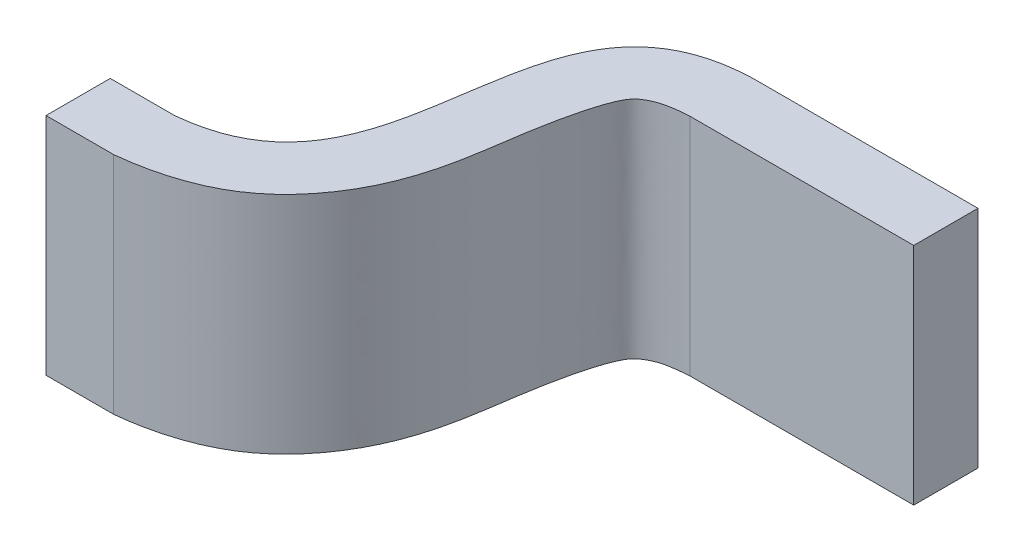
ISO-10303-21;
HEADER;
FILE_DESCRIPTION(('STEP AP214'),'2;1');
FILE_NAME('part.step','',(''),(''),'','','');
FILE_SCHEMA(('AUTOMOTIVE_DESIGN { 1 0 10303 214 1 1 1 1 }'));
ENDSEC;
DATA;
#1=APPLICATION_CONTEXT('core data for automotive mechanical design processes');
#2=APPLICATION_PROTOCOL_DEFINITION('international standard','automotive_design',2000,#1);
#3=PRODUCT_CONTEXT('',#1,'mechanical');
#4=PRODUCT('Part','Part','',(#3));
#5=PRODUCT_RELATED_PRODUCT_CATEGORY('part','',(#4));
#6=PRODUCT_DEFINITION_FORMATION('','',#4);
#7=PRODUCT_DEFINITION_CONTEXT('part definition',#1,'design');
#8=PRODUCT_DEFINITION('design','',#6,#7);
#9=PRODUCT_DEFINITION_SHAPE('','',#8);
#10=(LENGTH_UNIT() NAMED_UNIT(*) SI_UNIT(.MILLI.,.METRE.));
#11=(NAMED_UNIT(*) PLANE_ANGLE_UNIT() SI_UNIT($,.RADIAN.));
#12=(NAMED_UNIT(*) SI_UNIT($,.STERADIAN.) SOLID_ANGLE_UNIT());
#13=UNCERTAINTY_MEASURE_WITH_UNIT(LENGTH_MEASURE(1.E-05),#10,'distance_accuracy_value','');
#14=(GEOMETRIC_REPRESENTATION_CONTEXT(3) GLOBAL_UNCERTAINTY_ASSIGNED_CONTEXT((#13)) GLOBAL_UNIT_ASSIGNED_CONTEXT((#10,
#11,#12)) REPRESENTATION_CONTEXT('',''));
#15=CARTESIAN_POINT('',(0.,0.,0.));
#16=DIRECTION('',(0.,0.,1.));
#17=DIRECTION('',(1.,0.,0.));
#18=AXIS2_PLACEMENT_3D('',#15,#16,#17);
#19=CARTESIAN_POINT('',(0.381074398756027,2.52309917032561,1.20000011583518));
#20=DIRECTION('',(0.,1.,4.37113882867379E-08));
#21=DIRECTION('',(-1.,0.,0.));
#22=AXIS2_PLACEMENT_3D('',#19,#20,#21);
#23=PLANE('',#22);
#24=DIRECTION('',(1.,0.,0.));
#25=VECTOR('',#24,1.);
#26=CARTESIAN_POINT('',(8.21957818049203,2.523099214037,0.200000115835179));
#27=LINE('',#26,#25);
#28=CARTESIAN_POINT('',(8.21957818049203,2.523099214037,0.200000115835179));
#29=VERTEX_POINT('',#28);
#30=CARTESIAN_POINT('',(8.91607439875603,2.523099214037,0.200000115835179));
#31=VERTEX_POINT('',#30);
#32=EDGE_CURVE('E11',#29,#31,#27,.T.);
#33=ORIENTED_EDGE('',*,*,#32,.F.);
#34=CARTESIAN_POINT('',(8.21957818049203,2.523099214037,0.200000115835179));
#35=CARTESIAN_POINT('',(8.21401047042364,2.52309921402727,0.200222776944905));
#36=CARTESIAN_POINT('',(8.2084492375196,2.52309921401197,0.200572641902588));
#37=CARTESIAN_POINT('',(8.19734075645456,2.5230992139714,0.201500774403511));
#38=CARTESIAN_POINT('',(8.19179352491145,2.52309921394612,0.202079242715003));
#39=CARTESIAN_POINT('',(8.1806812900785,2.52309921388649,0.203443322434662));
#40=CARTESIAN_POINT('',(8.17511647873245,2.52309921385208,0.204230494227507));
#41=CARTESIAN_POINT('',(8.16402483417436,2.52309921377334,0.206032025455519));
#42=CARTESIAN_POINT('',(8.15849799412173,2.523099213729,0.207046342801843));
#43=CARTESIAN_POINT('',(8.14658674806992,2.52309921361617,0.209627439938685));
#44=CARTESIAN_POINT('',(8.14021486717337,2.52309921354485,0.211258532996008));
#45=CARTESIAN_POINT('',(8.12922884181096,2.52309921338631,0.214886282236413));
#46=CARTESIAN_POINT('',(8.12455816053052,2.52309921330695,0.21670276057125));
#47=CARTESIAN_POINT('',(8.11576316126025,2.52309921313023,0.220743140574117));
#48=CARTESIAN_POINT('',(8.11162296951039,2.52309921303433,0.222934029282874));
#49=CARTESIAN_POINT('',(8.10254423156373,2.52309921280874,0.228105288870863));
#50=CARTESIAN_POINT('',(8.09763875402522,2.52309921267634,0.231151795559119));
#51=CARTESIAN_POINT('',(8.09023645619511,2.52309921241795,0.237031494419059));
#52=CARTESIAN_POINT('',(8.08750404217203,2.52309921230647,0.239554186113198));
#53=CARTESIAN_POINT('',(8.08247327048636,2.52309921207143,0.245002831356052));
#54=CARTESIAN_POINT('',(8.08017570164472,2.52309921194784,0.247929501418367));
#55=CARTESIAN_POINT('',(8.07600750655781,2.52309921168262,0.253960636256992));
#56=CARTESIAN_POINT('',(8.07412791295759,2.52309921154149,0.257059103738853));
#57=CARTESIAN_POINT('',(8.07061884711942,2.52309921126739,0.263392983262519));
#58=CARTESIAN_POINT('',(8.06898949912773,2.52309921113442,0.266628462319743));
#59=CARTESIAN_POINT('',(8.06368568552224,2.52309921066809,0.27784996142524));
#60=CARTESIAN_POINT('',(8.06041325635019,2.52309921031974,0.286022147622744));
#61=CARTESIAN_POINT('',(8.05219767575063,2.52309920934111,0.308422259036948));
#62=CARTESIAN_POINT('',(8.04772694785476,2.52309920868692,0.322813352311754));
#63=CARTESIAN_POINT('',(8.03962993037269,2.52309920741242,0.351470017552813));
#64=CARTESIAN_POINT('',(8.03598677320328,2.52309920679168,0.365731021163682));
#65=CARTESIAN_POINT('',(8.0292057912753,2.52309920554215,0.39436223602706));
#66=CARTESIAN_POINT('',(8.026067670572,2.52309920491338,0.408732378117503));
#67=CARTESIAN_POINT('',(8.01737649852023,2.5230992030587,0.451139639563148));
#68=CARTESIAN_POINT('',(8.01233758089064,2.52309920182899,0.47928285266773));
#69=CARTESIAN_POINT('',(8.0033688768371,2.5230991993584,0.535811291131599));
#70=CARTESIAN_POINT('',(7.99944209123785,2.52309919811749,0.564196962317594));
#71=CARTESIAN_POINT('',(7.99171406777027,2.52309919586484,0.615729883457316));
#72=CARTESIAN_POINT('',(7.98801955213797,2.52309919485241,0.638892226484107));
#73=CARTESIAN_POINT('',(7.97944793328662,2.52309919283673,0.685005925928554));
#74=CARTESIAN_POINT('',(7.97457098452208,2.52309919183349,0.707957309496567));
#75=CARTESIAN_POINT('',(7.96312511462686,2.5230991898501,0.75333171452918));
#76=CARTESIAN_POINT('',(7.95656434385538,2.52309918886988,0.775756728489751));
#77=CARTESIAN_POINT('',(7.94138023978948,2.52309918694059,0.819893767638996));
#78=CARTESIAN_POINT('',(7.93275798105253,2.52309918599151,0.841606157601738));
#79=CARTESIAN_POINT('',(7.91045031887107,2.52309918386922,0.890158492103329));
#80=CARTESIAN_POINT('',(7.89602176505836,2.52309918271068,0.91666275844051));
#81=CARTESIAN_POINT('',(7.86348674764205,2.52309918049229,0.967413518681065));
#82=CARTESIAN_POINT('',(7.84537217243352,2.52309917943267,0.991654858034515));
#83=CARTESIAN_POINT('',(7.80791242379023,2.5230991775742,1.03417172187135));
#84=CARTESIAN_POINT('',(7.78898672481745,2.52309917675931,1.05281426512947));
#85=CARTESIAN_POINT('',(7.74845805610151,2.52309917527256,1.0868270722472));
#86=CARTESIAN_POINT('',(7.72686395650978,2.52309917460025,1.10220773934811));
#87=CARTESIAN_POINT('',(7.68360712676313,2.52309917348125,1.12780737627416));
#88=CARTESIAN_POINT('',(7.66215097272193,2.52309917301908,1.13838063101694));
#89=CARTESIAN_POINT('',(7.61807803282734,2.52309917220848,1.15692500960786));
#90=CARTESIAN_POINT('',(7.59545709543127,2.5230991718605,1.16488595544565));
#91=CARTESIAN_POINT('',(7.54849735175116,2.52309917125163,1.17881519350098));
#92=CARTESIAN_POINT('',(7.52412722595023,2.52309917099544,1.18467623918143));
#93=CARTESIAN_POINT('',(7.47515350623731,2.52309917058663,1.19402877138319));
#94=CARTESIAN_POINT('',(7.45055381030961,2.52309917043313,1.19754050603349));
#95=CARTESIAN_POINT('',(7.42587357560403,2.52309917032561,1.20000011583518));
#96=B_SPLINE_CURVE_WITH_KNOTS('',3,(#34,#35,#36,#37,#38,#39,#40,#41,#42,#43,#44,#45,#46,#47,#48,
#49,#50,#51,#52,#53,#54,#55,#56,#57,#58,#59,#60,#61,#62,#63,#64,#65,#66,#67,#68,#69,#70,#71,#72,
#73,#74,#75,#76,#77,#78,#79,#80,#81,#82,#83,#84,#85,#86,#87,#88,#89,#90,#91,#92,#93,#94,#95),
.UNSPECIFIED.,.F.,.F.,(4,2,2,2,2,2,2,2,2,2,2,2,2,2,2,2,2,2,2,2,2,2,2,2,2,2,2,2,2,2,4),(0.,
0.0167129049826591,0.0334405206169283,0.050296911907848,0.0671501823813316,0.0868449977925691,
0.101838970321109,0.115885127156855,0.133132127804881,0.14423621311223,0.155360252414292,
0.166215762863012,0.177076645740443,0.203446553112081,0.248618617741092,0.292765096579113,
0.336885611219413,0.422622380023038,0.508588331833534,0.57894141481707,0.649285312924717,
0.719294937731862,0.789268149044624,0.879502218060834,0.96993705004023,1.04934324822106,
1.12849225200604,1.200024637838,1.27183250557102,1.34691026454657,1.42133231106535),.UNSPECIFIED.);
#97=CARTESIAN_POINT('',(7.42587357560403,2.52309917032561,1.20000011583518));
#98=VERTEX_POINT('',#97);
#99=EDGE_CURVE('E144',#29,#98,#96,.T.);
#100=ORIENTED_EDGE('',*,*,#99,.T.);
#101=DIRECTION('',(1.,0.,0.));
#102=VECTOR('',#101,1.);
#103=CARTESIAN_POINT('',(7.21607439875603,2.52309917032561,1.20000011583518));
#104=LINE('',#103,#102);
#105=CARTESIAN_POINT('',(7.21607439875603,2.52309917032561,1.20000011583518));
#106=VERTEX_POINT('',#105);
#107=EDGE_CURVE('E153',#106,#98,#104,.T.);
#108=ORIENTED_EDGE('',*,*,#107,.F.);
#109=DIRECTION('',(0.,4.37113878426487E-08,-0.999999999999999));
#110=VECTOR('',#109,1.);
#111=CARTESIAN_POINT('',(7.21607439875603,2.52309917032561,1.20000011583518));
#112=LINE('',#111,#110);
#113=CARTESIAN_POINT('',(7.21607439875603,2.52309917906789,1.00000011583518));
#114=VERTEX_POINT('',#113);
#115=EDGE_CURVE('E176',#106,#114,#112,.T.);
#116=ORIENTED_EDGE('',*,*,#115,.T.);
#117=DIRECTION('',(-1.,0.,0.));
#118=VECTOR('',#117,1.);
#119=CARTESIAN_POINT('',(7.41607439875603,2.52309917906788,1.00000011583518));
#120=LINE('',#119,#118);
#121=CARTESIAN_POINT('',(7.41607439875603,2.52309917906789,1.00000011583518));
#122=VERTEX_POINT('',#121);
#123=EDGE_CURVE('E166',#122,#114,#120,.T.);
#124=ORIENTED_EDGE('',*,*,#123,.F.);
#125=CARTESIAN_POINT('',(8.21607439875603,2.52309922277927,1.15835178985639E-07));
#126=CARTESIAN_POINT('',(8.19359750090305,2.52309922274641,0.000752060468584343));
#127=CARTESIAN_POINT('',(8.17102033253113,2.52309922266874,0.00252901377854264));
#128=CARTESIAN_POINT('',(8.12598549255526,2.52309922238647,0.00898640023387568));
#129=CARTESIAN_POINT('',(8.10353378116303,2.52309922218014,0.0137066074111801));
#130=CARTESIAN_POINT('',(8.06516605596456,2.52309922167395,0.0252870083113101));
#131=CARTESIAN_POINT('',(8.04901169028135,2.52309922141004,0.0313245870723105));
#132=CARTESIAN_POINT('',(8.01790380459713,2.52309922077657,0.0458166204881481));
#133=CARTESIAN_POINT('',(8.00294442627384,2.52309922040757,0.0542582222089984));
#134=CARTESIAN_POINT('',(7.97582167191426,2.52309921959494,0.0728490012215342));
#135=CARTESIAN_POINT('',(7.96353091436025,2.52309921915947,0.0828115771405222));
#136=CARTESIAN_POINT('',(7.94070621502396,2.52309921820722,0.104596721389232));
#137=CARTESIAN_POINT('',(7.93017445817697,2.52309921769033,0.116421568042135));
#138=CARTESIAN_POINT('',(7.90935508116188,2.5230992165021,0.14360516530755));
#139=CARTESIAN_POINT('',(7.89940970116876,2.52309921581941,0.159223393880875));
#140=CARTESIAN_POINT('',(7.88179108799282,2.52309921439959,0.191705024628725));
#141=CARTESIAN_POINT('',(7.8741236490106,2.52309921366233,0.208571468087363));
#142=CARTESIAN_POINT('',(7.85832464058284,2.52309921190374,0.248803432527051));
#143=CARTESIAN_POINT('',(7.85090890706547,2.52309921087046,0.272442120704842));
#144=CARTESIAN_POINT('',(7.83820894045457,2.52309920878153,0.320231127397664));
#145=CARTESIAN_POINT('',(7.83292359852321,2.5230992077259,0.34438117285117));
#146=CARTESIAN_POINT('',(7.82020763349268,2.52309920485188,0.410131041851887));
#147=CARTESIAN_POINT('',(7.81392194525158,2.5230992030246,0.451934402083062));
#148=CARTESIAN_POINT('',(7.8012428083788,2.52309919936021,0.535765928705813));
#149=CARTESIAN_POINT('',(7.79484895474965,2.52309919752309,0.577794051692639));
#150=CARTESIAN_POINT('',(7.78273984807099,2.52309919483153,0.639369848598377));
#151=CARTESIAN_POINT('',(7.77842057810017,2.52309919396597,0.659171782886781));
#152=CARTESIAN_POINT('',(7.76847573352189,2.52309919224811,0.698471838212415));
#153=CARTESIAN_POINT('',(7.76284917548215,2.52309919139583,0.717969718676912));
#154=CARTESIAN_POINT('',(7.74981596903728,2.52309918972668,0.756155364665875));
#155=CARTESIAN_POINT('',(7.74242864611761,2.52309918890953,0.774849489753709));
#156=CARTESIAN_POINT('',(7.72530005700014,2.52309918732471,0.81110604819965));
#157=CARTESIAN_POINT('',(7.71556458954354,2.52309918655692,0.828671136436785));
#158=CARTESIAN_POINT('',(7.69292951988902,2.52309918507648,0.862539616126326));
#159=CARTESIAN_POINT('',(7.67993520495926,2.52309918436653,0.878781377405072));
#160=CARTESIAN_POINT('',(7.65100399267901,2.52309918307223,0.908391476138886));
#161=CARTESIAN_POINT('',(7.63506980602138,2.52309918248776,0.921762436225387));
#162=CARTESIAN_POINT('',(7.60252456066282,2.52309918151385,0.944042929275911));
#163=CARTESIAN_POINT('',(7.58611569627056,2.52309918111129,0.953252501908176));
#164=CARTESIAN_POINT('',(7.55201487673193,2.52309918042161,0.969030528465975));
#165=CARTESIAN_POINT('',(7.53431790582258,2.52309918013498,0.975587925812752));
#166=CARTESIAN_POINT('',(7.4998876879737,2.52309917968513,0.985879214749981));
#167=CARTESIAN_POINT('',(7.48321202321778,2.5230991795131,0.989814821998697));
#168=CARTESIAN_POINT('',(7.44972396115948,2.52309917924115,0.996036316685444));
#169=CARTESIAN_POINT('',(7.43291463042139,2.52309917914053,0.998338413303284));
#170=CARTESIAN_POINT('',(7.41607439875603,2.52309917906789,1.00000011583518));
#171=B_SPLINE_CURVE_WITH_KNOTS('',3,(#125,#126,#127,#128,#129,#130,#131,#132,#133,#134,#135,
#136,#137,#138,#139,#140,#141,#142,#143,#144,#145,#146,#147,#148,#149,#150,#151,#152,#153,#154,
#155,#156,#157,#158,#159,#160,#161,#162,#163,#164,#165,#166,#167,#168,#169,#170),.UNSPECIFIED.,
.F.,.F.,(4,2,2,2,2,2,2,2,2,2,2,2,2,2,2,2,2,2,2,2,2,2,4),(0.,0.0676605368254357,
0.136255841823746,0.187815232472052,0.239103979458826,0.286357475935168,0.333669238509407,
0.388978971846573,0.444428210357162,0.518581097757565,0.592695339665637,0.719482422739696,
0.846974988060583,0.907746805484861,0.96856448853661,1.02874313069962,1.08877465652057,
1.15080863583324,1.21278570033355,1.26897458836371,1.32539536427915,1.3767136749948,
1.42751535438906),.UNSPECIFIED.);
#172=CARTESIAN_POINT('',(8.21607439875603,2.52309922277927,1.15835178959856E-07));
#173=VERTEX_POINT('',#172);
#174=EDGE_CURVE('E99',#173,#122,#171,.T.);
#175=ORIENTED_EDGE('',*,*,#174,.F.);
#176=DIRECTION('',(1.,0.,0.));
#177=VECTOR('',#176,1.);
#178=CARTESIAN_POINT('',(8.21607439875603,2.52309922277928,1.15835178959856E-07));
#179=LINE('',#178,#177);
#180=CARTESIAN_POINT('',(8.91607439875603,2.52309922277927,1.15835178959856E-07));
#181=VERTEX_POINT('',#180);
#182=EDGE_CURVE('E93',#173,#181,#179,.T.);
#183=ORIENTED_EDGE('',*,*,#182,.T.);
#184=DIRECTION('',(0.,4.37113878426487E-08,-0.999999999999999));
#185=VECTOR('',#184,1.);
#186=CARTESIAN_POINT('',(8.91607439875603,2.523099214037,0.200000115835179));
#187=LINE('',#186,#185);
#188=EDGE_CURVE('E145',#31,#181,#187,.T.);
#189=ORIENTED_EDGE('',*,*,#188,.F.);
#190=EDGE_LOOP('',(#33,#100,#108,#116,#124,#175,#183,#189));
#191=FACE_BOUND('',#190,.T.);
#192=ADVANCED_FACE('F17',(#191),#23,.F.);
#193=CARTESIAN_POINT('',(8.91607439875603,-0.126900829674392,1.2));
#194=DIRECTION('',(-1.,0.,0.));
#195=DIRECTION('',(0.,-1.,-4.37113882867379E-08));
#196=AXIS2_PLACEMENT_3D('',#193,#194,#195);
#197=PLANE('',#196);
#198=DIRECTION('',(0.,-0.999999999999999,-4.37113883184585E-08));
#199=VECTOR('',#198,1.);
#200=CARTESIAN_POINT('',(8.91607439875603,3.223099214037,0.200000146433151));
#201=LINE('',#200,#199);
#202=CARTESIAN_POINT('',(8.91607439875603,3.223099214037,0.200000146433151));
#203=VERTEX_POINT('',#202);
#204=EDGE_CURVE('E25',#203,#31,#201,.T.);
#205=ORIENTED_EDGE('',*,*,#204,.T.);
#206=ORIENTED_EDGE('',*,*,#188,.T.);
#207=DIRECTION('',(0.,0.999999999999999,4.37113882867379E-08));
#208=VECTOR('',#207,1.);
#209=CARTESIAN_POINT('',(8.91607439875603,2.52309922277927,1.15835178959856E-07));
#210=LINE('',#209,#208);
#211=CARTESIAN_POINT('',(8.91607439875603,3.22309922277927,1.46433150760572E-07));
#212=VERTEX_POINT('',#211);
#213=EDGE_CURVE('E178',#181,#212,#210,.T.);
#214=ORIENTED_EDGE('',*,*,#213,.T.);
#215=DIRECTION('',(0.,4.37113856222026E-08,-0.999999999999999));
#216=VECTOR('',#215,1.);
#217=CARTESIAN_POINT('',(8.91607439875603,3.223099214037,0.200000146433151));
#218=LINE('',#217,#216);
#219=EDGE_CURVE('E168',#203,#212,#218,.T.);
#220=ORIENTED_EDGE('',*,*,#219,.F.);
#221=EDGE_LOOP('',(#205,#206,#214,#220));
#222=FACE_BOUND('',#221,.T.);
#223=ADVANCED_FACE('F129',(#222),#197,.F.);
#224=CARTESIAN_POINT('',(0.381074398756027,3.22309917032561,1.20000014643315));
#225=DIRECTION('',(0.,1.,4.37113882867379E-08));
#226=DIRECTION('',(-1.,0.,0.));
#227=AXIS2_PLACEMENT_3D('',#224,#225,#226);
#228=PLANE('',#227);
#229=CARTESIAN_POINT('',(7.42587357560403,3.22309917032561,1.20000014643315));
#230=CARTESIAN_POINT('',(7.44450696231857,3.22309917040612,1.19815829311156));
#231=CARTESIAN_POINT('',(7.46308378697548,3.22309917051351,1.1957015166836));
#232=CARTESIAN_POINT('',(7.50006101029373,3.22309917078471,1.18949711709641));
#233=CARTESIAN_POINT('',(7.51846094169025,3.22309917094865,1.18574671960165));
#234=CARTESIAN_POINT('',(7.55510393371644,3.22309917133702,1.1768617432686));
#235=CARTESIAN_POINT('',(7.57334409155655,3.22309917156199,1.17171500907457));
#236=CARTESIAN_POINT('',(7.60932052096594,3.22309917207712,1.15993021636413));
#237=CARTESIAN_POINT('',(7.62705717651152,3.22309917236723,1.15329333065392));
#238=CARTESIAN_POINT('',(7.66764342416262,3.22309917313077,1.13582561747603));
#239=CARTESIAN_POINT('',(7.69022170006956,3.22309917363307,1.12433441236624));
#240=CARTESIAN_POINT('',(7.73311709417893,3.2230991747892,1.09788519223996));
#241=CARTESIAN_POINT('',(7.75344430120095,3.22309917544231,1.08294365553174));
#242=CARTESIAN_POINT('',(7.79010917597914,3.2230991768155,1.05152865848007));
#243=CARTESIAN_POINT('',(7.80663564372869,3.22309917752611,1.03527196246281));
#244=CARTESIAN_POINT('',(7.83757005773216,3.22309917903329,1.00079164379412));
#245=CARTESIAN_POINT('',(7.85197241919277,3.22309917983008,0.982563046992551));
#246=CARTESIAN_POINT('',(7.8802341685402,3.22309918158959,0.942310265469554));
#247=CARTESIAN_POINT('',(7.89381844801596,3.22309918256072,0.920093478990381));
#248=CARTESIAN_POINT('',(7.91820429984428,3.22309918456551,0.874229263846631));
#249=CARTESIAN_POINT('',(7.92900959422008,3.22309918559908,0.850583801679557));
#250=CARTESIAN_POINT('',(7.94871551674147,3.22309918779927,0.800249273213149));
#251=CARTESIAN_POINT('',(7.95738403816721,3.22309918896982,0.773470381934673));
#252=CARTESIAN_POINT('',(7.97210425943558,3.22309919134218,0.719197126059223));
#253=CARTESIAN_POINT('',(7.97815277621527,3.22309919254403,0.691701933955639));
#254=CARTESIAN_POINT('',(7.98659346655188,3.22309919451031,0.646718729204653));
#255=CARTESIAN_POINT('',(7.98950808079972,3.22309919527076,0.629321589990211));
#256=CARTESIAN_POINT('',(7.99495752836008,3.22309919679438,0.594465181726221));
#257=CARTESIAN_POINT('',(7.99749227542006,3.22309919755755,0.577005899485014));
#258=CARTESIAN_POINT('',(8.00258019010342,3.22309919908365,0.542092952289066));
#259=CARTESIAN_POINT('',(8.00513335408043,3.22309919984657,0.524639286900345));
#260=CARTESIAN_POINT('',(8.01067664140315,3.22309920136919,0.489805741266522));
#261=CARTESIAN_POINT('',(8.01366664660187,3.22309920212889,0.472425842374471));
#262=CARTESIAN_POINT('',(8.02154183196176,3.22309920398264,0.43001703289886));
#263=CARTESIAN_POINT('',(8.026677647503,3.22309920507476,0.405032304682354));
#264=CARTESIAN_POINT('',(8.03549422069925,3.22309920670166,0.367813027851881));
#265=CARTESIAN_POINT('',(8.03861929488698,3.22309920724219,0.355447107207851));
#266=CARTESIAN_POINT('',(8.04538178604434,3.22309920831701,0.330858216277031));
#267=CARTESIAN_POINT('',(8.04901891512481,3.22309920885131,0.318635169816699));
#268=CARTESIAN_POINT('',(8.05549287491962,3.22309920969325,0.29937351408224));
#269=CARTESIAN_POINT('',(8.05805542449796,3.22309921000488,0.292244100310988));
#270=CARTESIAN_POINT('',(8.06363353655652,3.22309921062001,0.278172012219553));
#271=CARTESIAN_POINT('',(8.06664841291152,3.22309921092352,0.271229073529861));
#272=CARTESIAN_POINT('',(8.07291634166038,3.22309921145799,0.259000061277761));
#273=CARTESIAN_POINT('',(8.07602245220972,3.22309921169199,0.25364488459391));
#274=CARTESIAN_POINT('',(8.08295261429228,3.22309921209999,0.244316143597421));
#275=CARTESIAN_POINT('',(8.08664880136107,3.22309921227781,0.240254122817685));
#276=CARTESIAN_POINT('',(8.09609777114538,3.22309921263433,0.232076112648614));
#277=CARTESIAN_POINT('',(8.10213521795419,3.22309921279752,0.228304198420806));
#278=CARTESIAN_POINT('',(8.11135187843241,3.22309921302631,0.223113238150879));
#279=CARTESIAN_POINT('',(8.11443840401739,3.22309921309965,0.221466306758504));
#280=CARTESIAN_POINT('',(8.12072868843963,3.22309921323099,0.218417518195716));
#281=CARTESIAN_POINT('',(8.12393212492761,3.22309921328903,0.217015040865018));
#282=CARTESIAN_POINT('',(8.1330523200996,3.22309921343936,0.213465188849452));
#283=CARTESIAN_POINT('',(8.13908573097743,3.22309921352181,0.211621845714586));
#284=CARTESIAN_POINT('',(8.14885449437696,3.22309921363485,0.20913735378251));
#285=CARTESIAN_POINT('',(8.15254767389704,3.22309921367301,0.208309839512023));
#286=CARTESIAN_POINT('',(8.15996325473587,3.22309921374053,0.20679980459063));
#287=CARTESIAN_POINT('',(8.16368565174552,3.22309921376988,0.206117262960337));
#288=CARTESIAN_POINT('',(8.17604847837331,3.22309921386012,0.204032222659834));
#289=CARTESIAN_POINT('',(8.18472828231269,3.22309921391181,0.202861256763462));
#290=CARTESIAN_POINT('',(8.19777924698608,3.22309921397252,0.201476741708386));
#291=CARTESIAN_POINT('',(8.20213187370674,3.22309921398994,0.20107736788705));
#292=CARTESIAN_POINT('',(8.2108475193358,3.22309921401843,0.200424137179815));
#293=CARTESIAN_POINT('',(8.21521053727932,3.2230992140295,0.200170267274331));
#294=CARTESIAN_POINT('',(8.21957818049203,3.223099214037,0.200000146433151));
#295=B_SPLINE_CURVE_WITH_KNOTS('',3,(#229,#230,#231,#232,#233,#234,#235,#236,#237,#238,#239,
#240,#241,#242,#243,#244,#245,#246,#247,#248,#249,#250,#251,#252,#253,#254,#255,#256,#257,#258,
#259,#260,#261,#262,#263,#264,#265,#266,#267,#268,#269,#270,#271,#272,#273,#274,#275,#276,#277,
#278,#279,#280,#281,#282,#283,#284,#285,#286,#287,#288,#289,#290,#291,#292,#293,#294),
.UNSPECIFIED.,.F.,.F.,(4,2,2,2,2,2,2,2,2,2,2,2,2,2,2,2,2,2,2,2,2,2,2,2,2,2,2,2,2,2,2,2,4),(0.,
0.0561681589095688,0.112457534383134,0.169253578612363,0.226005077906876,0.301715004036535,
0.377070566345992,0.446424912055148,0.515958475234814,0.593880428548582,0.671697467408242,
0.755964517163007,0.840333658382207,0.893247792631836,0.946173923407368,0.99908984816416,
1.05199148781441,1.12847716172405,1.16673541076623,1.20497223539783,1.22769072756633,
1.25037510056687,1.26886797593494,1.28517999290264,1.30634908955326,1.31685139211729,
1.32732665061524,1.34619861049413,1.3575513722042,1.36890248990408,1.39515927363249,
1.40827024085607,1.42138003473644),.UNSPECIFIED.);
#296=CARTESIAN_POINT('',(7.42587357560403,3.22309917032561,1.20000014643315));
#297=VERTEX_POINT('',#296);
#298=CARTESIAN_POINT('',(8.21957818049203,3.223099214037,0.200000146433151));
#299=VERTEX_POINT('',#298);
#300=EDGE_CURVE('E137',#297,#299,#295,.T.);
#301=ORIENTED_EDGE('',*,*,#300,.T.);
#302=DIRECTION('',(-1.,0.,0.));
#303=VECTOR('',#302,1.);
#304=CARTESIAN_POINT('',(8.91607439875603,3.223099214037,0.20000014643315));
#305=LINE('',#304,#303);
#306=EDGE_CURVE('E180',#203,#299,#305,.T.);
#307=ORIENTED_EDGE('',*,*,#306,.F.);
#308=ORIENTED_EDGE('',*,*,#219,.T.);
#309=DIRECTION('',(1.,0.,0.));
#310=VECTOR('',#309,1.);
#311=CARTESIAN_POINT('',(8.21607439875603,3.22309922277928,1.46433150760572E-07));
#312=LINE('',#311,#310);
#313=CARTESIAN_POINT('',(8.21607439875603,3.22309922277927,1.46433150760572E-07));
#314=VERTEX_POINT('',#313);
#315=EDGE_CURVE('E89',#314,#212,#312,.T.);
#316=ORIENTED_EDGE('',*,*,#315,.F.);
#317=CARTESIAN_POINT('',(7.41607439875603,3.22309917906789,1.00000014643315));
#318=CARTESIAN_POINT('',(7.43817018222186,3.22309917916311,0.997821656245107));
#319=CARTESIAN_POINT('',(7.46028248507753,3.2230991793072,0.994525285186108));
#320=CARTESIAN_POINT('',(7.50409640205193,3.22309917972469,0.984974292672356));
#321=CARTESIAN_POINT('',(7.52579079095056,3.2230991799995,0.978687426312376));
#322=CARTESIAN_POINT('',(7.56323568888655,3.22309918063201,0.964217354769986));
#323=CARTESIAN_POINT('',(7.57925238017961,3.22309918095865,0.956744450547587));
#324=CARTESIAN_POINT('',(7.60984744345818,3.22309918171697,0.939396203850119));
#325=CARTESIAN_POINT('',(7.62443222356208,3.22309918214814,0.929532321418257));
#326=CARTESIAN_POINT('',(7.65127355429857,3.22309918309555,0.907858113568547));
#327=CARTESIAN_POINT('',(7.66359189311382,3.22309918360844,0.896124373556237));
#328=CARTESIAN_POINT('',(7.68623973177649,3.22309918471315,0.870851495061247));
#329=CARTESIAN_POINT('',(7.69656581930069,3.2230991853051,0.857309325052826));
#330=CARTESIAN_POINT('',(7.7288599653506,3.22309918745188,0.808196686858194));
#331=CARTESIAN_POINT('',(7.74578219402698,3.22309918914941,0.769361701724756));
#332=CARTESIAN_POINT('',(7.76851555094968,3.22309919217834,0.700067913553523));
#333=CARTESIAN_POINT('',(7.77606917338715,3.22309919349072,0.670044164635465));
#334=CARTESIAN_POINT('',(7.78894702253641,3.223099196139,0.609458584143952));
#335=CARTESIAN_POINT('',(7.79426746653087,3.22309919747493,0.578895930227288));
#336=CARTESIAN_POINT('',(7.80737252762368,3.22309920105377,0.497021644491724));
#337=CARTESIAN_POINT('',(7.81440202819144,3.22309920330128,0.44560482164505));
#338=CARTESIAN_POINT('',(7.82797469405163,3.22309920665086,0.368975338703383));
#339=CARTESIAN_POINT('',(7.83300116933564,3.22309920776336,0.34352437223184));
#340=CARTESIAN_POINT('',(7.8450377099592,3.22309920996658,0.293120494476765));
#341=CARTESIAN_POINT('',(7.85204451695726,3.22309921105734,0.26816683654935));
#342=CARTESIAN_POINT('',(7.86967882133572,3.22309921323841,0.218269786618546));
#343=CARTESIAN_POINT('',(7.88044603179669,3.22309921432677,0.193370846879312));
#344=CARTESIAN_POINT('',(7.90028149828643,3.22309921586495,0.158181406897515));
#345=CARTESIAN_POINT('',(7.90747873152155,3.22309921636052,0.14684411319455));
#346=CARTESIAN_POINT('',(7.92319628097518,3.22309921730947,0.125134699088059));
#347=CARTESIAN_POINT('',(7.93171533183735,3.22309921776288,0.114761670638015));
#348=CARTESIAN_POINT('',(7.95305079729199,3.22309921875355,0.0920977534487854));
#349=CARTESIAN_POINT('',(7.96636683173803,3.22309921927065,0.0802681917571239));
#350=CARTESIAN_POINT('',(7.9949416924925,3.22309922019085,0.0592163752155731));
#351=CARTESIAN_POINT('',(8.01020376688035,3.22309922059377,0.0499985643969288));
#352=CARTESIAN_POINT('',(8.04269320473982,3.22309922129869,0.0338719816870512));
#353=CARTESIAN_POINT('',(8.059976592337,3.22309922159565,0.0270783020968794));
#354=CARTESIAN_POINT('',(8.09534530324317,3.22309922208002,0.0159972198194002));
#355=CARTESIAN_POINT('',(8.11343240408648,3.22309922226717,0.0117157036808146));
#356=CARTESIAN_POINT('',(8.14567062680494,3.2230992225183,0.00597065826712708));
#357=CARTESIAN_POINT('',(8.15975136088267,3.22309922260085,0.00408197404209036));
#358=CARTESIAN_POINT('',(8.18791264005314,3.2230992227211,0.00133098364696556));
#359=CARTESIAN_POINT('',(8.2019924559053,3.22309922275911,0.000461382229158056));
#360=CARTESIAN_POINT('',(8.21607439875606,3.22309922277927,1.46433149535788E-07));
#361=B_SPLINE_CURVE_WITH_KNOTS('',3,(#317,#318,#319,#320,#321,#322,#323,#324,#325,#326,#327,
#328,#329,#330,#331,#332,#333,#334,#335,#336,#337,#338,#339,#340,#341,#342,#343,#344,#345,#346,
#347,#348,#349,#350,#351,#352,#353,#354,#355,#356,#357,#358,#359,#360),.UNSPECIFIED.,.F.,.F.,(4,
2,2,2,2,2,2,2,2,2,2,2,2,2,2,2,2,2,2,2,2,4),(0.,0.0667821137090826,0.134301214684022,
0.18712850882399,0.239707439757742,0.29051873145293,0.341416294675054,0.46671225908897,
0.559563019654506,0.652570428897919,0.808245450373593,0.886023921415193,0.963675157190785,
1.04458784966541,1.08478909463836,1.12495209032637,1.17807587168456,1.23128951042009,
1.2867700351769,1.34238004906254,1.38496468867344,1.42724258099922),.UNSPECIFIED.);
#362=CARTESIAN_POINT('',(7.41607439875603,3.22309917906789,1.00000014643315));
#363=VERTEX_POINT('',#362);
#364=EDGE_CURVE('E81',#363,#314,#361,.T.);
#365=ORIENTED_EDGE('',*,*,#364,.F.);
#366=DIRECTION('',(1.,0.,0.));
#367=VECTOR('',#366,1.);
#368=CARTESIAN_POINT('',(7.21607439875603,3.22309917906788,1.00000014643315));
#369=LINE('',#368,#367);
#370=CARTESIAN_POINT('',(7.21607439875603,3.22309917906789,1.00000014643315));
#371=VERTEX_POINT('',#370);
#372=EDGE_CURVE('E86',#371,#363,#369,.T.);
#373=ORIENTED_EDGE('',*,*,#372,.F.);
#374=DIRECTION('',(0.,4.37113878426487E-08,-0.999999999999999));
#375=VECTOR('',#374,1.);
#376=CARTESIAN_POINT('',(7.21607439875603,3.22309917032561,1.20000014643315));
#377=LINE('',#376,#375);
#378=CARTESIAN_POINT('',(7.21607439875603,3.22309917032561,1.20000014643315));
#379=VERTEX_POINT('',#378);
#380=EDGE_CURVE('E164',#379,#371,#377,.T.);
#381=ORIENTED_EDGE('',*,*,#380,.F.);
#382=DIRECTION('',(1.,0.,0.));
#383=VECTOR('',#382,1.);
#384=CARTESIAN_POINT('',(7.21607439875603,3.22309917032561,1.20000014643315));
#385=LINE('',#384,#383);
#386=EDGE_CURVE('E190',#379,#297,#385,.T.);
#387=ORIENTED_EDGE('',*,*,#386,.T.);
#388=EDGE_LOOP('',(#301,#307,#308,#316,#365,#373,#381,#387));
#389=FACE_BOUND('',#388,.T.);
#390=ADVANCED_FACE('F83',(#389),#228,.T.);
#391=CARTESIAN_POINT('',(7.21607439875603,-0.126900829674392,1.2));
#392=DIRECTION('',(-1.,0.,0.));
#393=DIRECTION('',(0.,-1.,-4.37113882867379E-08));
#394=AXIS2_PLACEMENT_3D('',#391,#392,#393);
#395=PLANE('',#394);
#396=ORIENTED_EDGE('',*,*,#380,.T.);
#397=DIRECTION('',(0.,-0.999999999999999,-4.37113881598552E-08));
#398=VECTOR('',#397,1.);
#399=CARTESIAN_POINT('',(7.21607439875603,3.22309917906789,1.00000014643315));
#400=LINE('',#399,#398);
#401=EDGE_CURVE('E107',#371,#114,#400,.T.);
#402=ORIENTED_EDGE('',*,*,#401,.T.);
#403=ORIENTED_EDGE('',*,*,#115,.F.);
#404=DIRECTION('',(0.,0.999999999999999,4.37113878426487E-08));
#405=VECTOR('',#404,1.);
#406=CARTESIAN_POINT('',(7.21607439875603,2.52309917032561,1.20000011583518));
#407=LINE('',#406,#405);
#408=EDGE_CURVE('E92',#106,#379,#407,.T.);
#409=ORIENTED_EDGE('',*,*,#408,.T.);
#410=EDGE_LOOP('',(#396,#402,#403,#409));
#411=FACE_BOUND('',#410,.T.);
#412=ADVANCED_FACE('F128',(#411),#395,.T.);
#413=CARTESIAN_POINT('',(0.381074398756027,-0.126900777220726,0.));
#414=DIRECTION('',(0.,-4.37113882867379E-08,1.));
#415=DIRECTION('',(0.,-1.,-4.37113882867379E-08));
#416=AXIS2_PLACEMENT_3D('',#413,#414,#415);
#417=PLANE('',#416);
#418=DIRECTION('',(0.,-0.999999999999999,-4.37113882867379E-08));
#419=VECTOR('',#418,1.);
#420=CARTESIAN_POINT('',(8.21607439875603,3.22309922277927,1.46433150760572E-07));
#421=LINE('',#420,#419);
#422=EDGE_CURVE('E174',#314,#173,#421,.T.);
#423=ORIENTED_EDGE('',*,*,#422,.F.);
#424=ORIENTED_EDGE('',*,*,#315,.T.);
#425=ORIENTED_EDGE('',*,*,#213,.F.);
#426=ORIENTED_EDGE('',*,*,#182,.F.);
#427=EDGE_LOOP('',(#423,#424,#425,#426));
#428=FACE_BOUND('',#427,.T.);
#429=ADVANCED_FACE('F227',(#428),#417,.F.);
#430=CARTESIAN_POINT('',(0.381074398756027,-0.126900829674392,1.2));
#431=DIRECTION('',(0.,-4.37113882867379E-08,1.));
#432=DIRECTION('',(0.,-1.,-4.37113882867379E-08));
#433=AXIS2_PLACEMENT_3D('',#430,#431,#432);
#434=PLANE('',#433);
#435=DIRECTION('',(0.,-0.999999999999999,-4.37113887942684E-08));
#436=VECTOR('',#435,1.);
#437=CARTESIAN_POINT('',(7.42587357560403,3.22309917032561,1.20000014643315));
#438=LINE('',#437,#436);
#439=EDGE_CURVE('E161',#297,#98,#438,.T.);
#440=ORIENTED_EDGE('',*,*,#439,.F.);
#441=ORIENTED_EDGE('',*,*,#386,.F.);
#442=ORIENTED_EDGE('',*,*,#408,.F.);
#443=ORIENTED_EDGE('',*,*,#107,.T.);
#444=EDGE_LOOP('',(#440,#441,#442,#443));
#445=FACE_BOUND('',#444,.T.);
#446=ADVANCED_FACE('F160',(#445),#434,.T.);
#447=CARTESIAN_POINT('',(0.381074398756027,5.01772964056189,1.00000022487894));
#448=DIRECTION('',(0.,4.37113882867379E-08,-1.));
#449=DIRECTION('',(0.,1.,4.37113882867379E-08));
#450=AXIS2_PLACEMENT_3D('',#447,#448,#449);
#451=PLANE('',#450);
#452=ORIENTED_EDGE('',*,*,#123,.T.);
#453=ORIENTED_EDGE('',*,*,#401,.F.);
#454=ORIENTED_EDGE('',*,*,#372,.T.);
#455=DIRECTION('',(0.,-0.999999999999999,-4.37113881598552E-08));
#456=VECTOR('',#455,1.);
#457=CARTESIAN_POINT('',(7.41607439875603,3.22309917906789,1.00000014643315));
#458=LINE('',#457,#456);
#459=EDGE_CURVE('E97',#363,#122,#458,.T.);
#460=ORIENTED_EDGE('',*,*,#459,.T.);
#461=EDGE_LOOP('',(#452,#453,#454,#460));
#462=FACE_BOUND('',#461,.T.);
#463=ADVANCED_FACE('F105',(#462),#451,.T.);
#464=CARTESIAN_POINT('',(7.41607439875603,5.01772964056189,1.00000022487894));
#465=CARTESIAN_POINT('',(8.06139179690003,5.01772964333266,0.93661226287194));
#466=CARTESIAN_POINT('',(7.55197768938303,5.01772968333384,0.0214920441178097));
#467=CARTESIAN_POINT('',(8.21607439875603,5.01772968427327,2.24878939694144E-07));
#468=B_SPLINE_CURVE_WITH_KNOTS('',3,(#464,#465,#466,#467),.UNSPECIFIED.,.F.,.F.,(4,4),(0.,1.),.UNSPECIFIED.);
#469=DIRECTION('',(0.,-0.999999999999999,-4.37113882867379E-08));
#470=VECTOR('',#469,1.);
#471=SURFACE_OF_LINEAR_EXTRUSION('',#468,#470);
#472=ORIENTED_EDGE('',*,*,#174,.T.);
#473=ORIENTED_EDGE('',*,*,#459,.F.);
#474=ORIENTED_EDGE('',*,*,#364,.T.);
#475=ORIENTED_EDGE('',*,*,#422,.T.);
#476=EDGE_LOOP('',(#472,#473,#474,#475));
#477=FACE_BOUND('',#476,.T.);
#478=ADVANCED_FACE('F98',(#477),#471,.T.);
#479=CARTESIAN_POINT('',(0.381074398756027,5.017729675531,0.20000022487894));
#480=DIRECTION('',(0.,-4.37113882867379E-08,1.));
#481=DIRECTION('',(-1.,0.,0.));
#482=AXIS2_PLACEMENT_3D('',#479,#480,#481);
#483=PLANE('',#482);
#484=ORIENTED_EDGE('',*,*,#32,.T.);
#485=ORIENTED_EDGE('',*,*,#204,.F.);
#486=ORIENTED_EDGE('',*,*,#306,.T.);
#487=DIRECTION('',(0.,-0.999999999999999,-4.37113883184585E-08));
#488=VECTOR('',#487,1.);
#489=CARTESIAN_POINT('',(8.21957818049203,3.223099214037,0.200000146433151));
#490=LINE('',#489,#488);
#491=EDGE_CURVE('E102',#299,#29,#490,.T.);
#492=ORIENTED_EDGE('',*,*,#491,.T.);
#493=EDGE_LOOP('',(#484,#485,#486,#492));
#494=FACE_BOUND('',#493,.T.);
#495=ADVANCED_FACE('F134',(#494),#483,.T.);
#496=CARTESIAN_POINT('',(7.42587357560403,5.01772963181961,1.20000022487894));
#497=CARTESIAN_POINT('',(7.52324797711103,5.0177296322377,1.19043537372094));
#498=CARTESIAN_POINT('',(7.72759639244103,5.01772963465043,1.13523848292794));
#499=CARTESIAN_POINT('',(7.96818915500203,5.01772964683219,0.85655227210794));
#500=CARTESIAN_POINT('',(8.00048622477203,5.01772966268883,0.49379478761794));
#501=CARTESIAN_POINT('',(8.06033428941003,5.01772967295241,0.25899132482694));
#502=CARTESIAN_POINT('',(8.09819089651203,5.01772967426447,0.22897490490494));
#503=CARTESIAN_POINT('',(8.14113192410003,5.01772967516896,0.20828275194794));
#504=CARTESIAN_POINT('',(8.19604029615203,5.01772967549165,0.20090043049794));
#505=CARTESIAN_POINT('',(8.21957818049203,5.017729675531,0.20000022487894));
#506=B_SPLINE_CURVE_WITH_KNOTS('',3,(#496,#497,#498,#499,#500,#501,#502,#503,#504,#505),
.UNSPECIFIED.,.F.,.F.,(4,1,1,1,1,1,1,4),(-0.005037439357121,0.120331553469,0.245700546295,
0.496438531947,0.747176517599,0.872545510425,0.935230006838,0.997914503251),.UNSPECIFIED.);
#507=DIRECTION('',(0.,-0.999999999999999,-4.37113882867379E-08));
#508=VECTOR('',#507,1.);
#509=SURFACE_OF_LINEAR_EXTRUSION('',#506,#508);
#510=ORIENTED_EDGE('',*,*,#491,.F.);
#511=ORIENTED_EDGE('',*,*,#300,.F.);
#512=ORIENTED_EDGE('',*,*,#439,.T.);
#513=ORIENTED_EDGE('',*,*,#99,.F.);
#514=EDGE_LOOP('',(#510,#511,#512,#513));
#515=FACE_BOUND('',#514,.T.);
#516=ADVANCED_FACE('F130',(#515),#509,.F.);
#517=CLOSED_SHELL('',(#192,#223,#390,#412,#429,#446,#463,#478,#495,#516));
#518=MANIFOLD_SOLID_BREP('B1',#517);
#519=ADVANCED_BREP_SHAPE_REPRESENTATION('',(#18,#518),#14);
#520=SHAPE_DEFINITION_REPRESENTATION(#9,#519);
ENDSEC;
END-ISO-10303-21;
